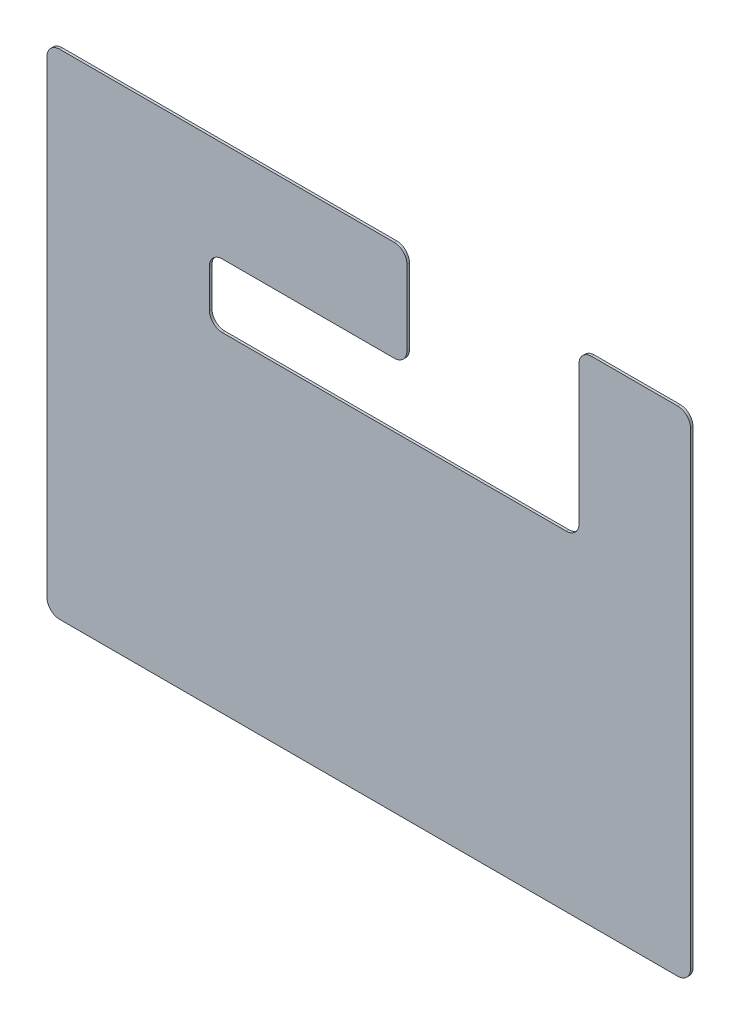
ISO-10303-21;
HEADER;
FILE_DESCRIPTION(('STEP AP214'),'2;1');
FILE_NAME('part.step','',(''),(''),'','','');
FILE_SCHEMA(('AUTOMOTIVE_DESIGN { 1 0 10303 214 1 1 1 1 }'));
ENDSEC;
DATA;
#1=APPLICATION_CONTEXT('core data for automotive mechanical design processes');
#2=APPLICATION_PROTOCOL_DEFINITION('international standard','automotive_design',2000,#1);
#3=PRODUCT_CONTEXT('',#1,'mechanical');
#4=PRODUCT('Part','Part','',(#3));
#5=PRODUCT_RELATED_PRODUCT_CATEGORY('part','',(#4));
#6=PRODUCT_DEFINITION_FORMATION('','',#4);
#7=PRODUCT_DEFINITION_CONTEXT('part definition',#1,'design');
#8=PRODUCT_DEFINITION('design','',#6,#7);
#9=PRODUCT_DEFINITION_SHAPE('','',#8);
#10=(LENGTH_UNIT() NAMED_UNIT(*) SI_UNIT(.MILLI.,.METRE.));
#11=(NAMED_UNIT(*) PLANE_ANGLE_UNIT() SI_UNIT($,.RADIAN.));
#12=(NAMED_UNIT(*) SI_UNIT($,.STERADIAN.) SOLID_ANGLE_UNIT());
#13=UNCERTAINTY_MEASURE_WITH_UNIT(LENGTH_MEASURE(1.E-05),#10,'distance_accuracy_value','');
#14=(GEOMETRIC_REPRESENTATION_CONTEXT(3) GLOBAL_UNCERTAINTY_ASSIGNED_CONTEXT((#13)) GLOBAL_UNIT_ASSIGNED_CONTEXT((#10,
#11,#12)) REPRESENTATION_CONTEXT('',''));
#15=CARTESIAN_POINT('',(0.,0.,0.));
#16=DIRECTION('',(0.,0.,1.));
#17=DIRECTION('',(1.,0.,0.));
#18=AXIS2_PLACEMENT_3D('',#15,#16,#17);
#19=CARTESIAN_POINT('',(-505.,387.5,4.));
#20=DIRECTION('',(0.,-1.,0.));
#21=DIRECTION('',(0.,0.,-1.));
#22=AXIS2_PLACEMENT_3D('',#19,#20,#21);
#23=PLANE('',#22);
#24=DIRECTION('',(-1.,0.,0.));
#25=VECTOR('',#24,1.);
#26=CARTESIAN_POINT('',(-505.,387.5,0.));
#27=LINE('',#26,#25);
#28=CARTESIAN_POINT('',(485.,387.5,0.));
#29=VERTEX_POINT('',#28);
#30=CARTESIAN_POINT('',(350.,387.5,0.));
#31=VERTEX_POINT('',#30);
#32=EDGE_CURVE('E202',#29,#31,#27,.T.);
#33=ORIENTED_EDGE('',*,*,#32,.T.);
#34=DIRECTION('',(0.,0.,1.));
#35=VECTOR('',#34,1.);
#36=CARTESIAN_POINT('',(350.,387.5,4.));
#37=LINE('',#36,#35);
#38=CARTESIAN_POINT('',(350.,387.5,4.));
#39=VERTEX_POINT('',#38);
#40=EDGE_CURVE('E267',#31,#39,#37,.T.);
#41=ORIENTED_EDGE('',*,*,#40,.T.);
#42=DIRECTION('',(-1.,0.,0.));
#43=VECTOR('',#42,1.);
#44=CARTESIAN_POINT('',(-505.,387.5,4.));
#45=LINE('',#44,#43);
#46=CARTESIAN_POINT('',(485.,387.5,4.));
#47=VERTEX_POINT('',#46);
#48=EDGE_CURVE('E331',#47,#39,#45,.T.);
#49=ORIENTED_EDGE('',*,*,#48,.F.);
#50=DIRECTION('',(0.,0.,-1.));
#51=VECTOR('',#50,1.);
#52=CARTESIAN_POINT('',(485.,387.5,4.));
#53=LINE('',#52,#51);
#54=EDGE_CURVE('E223',#47,#29,#53,.T.);
#55=ORIENTED_EDGE('',*,*,#54,.T.);
#56=EDGE_LOOP('',(#33,#41,#49,#55));
#57=FACE_BOUND('',#56,.T.);
#58=ADVANCED_FACE('F33',(#57),#23,.F.);
#59=CARTESIAN_POINT('',(0.,0.,4.));
#60=DIRECTION('',(0.,0.,-1.));
#61=DIRECTION('',(-1.,0.,0.));
#62=AXIS2_PLACEMENT_3D('',#59,#60,#61);
#63=PLANE('',#62);
#64=DIRECTION('',(0.,-1.,0.));
#65=VECTOR('',#64,1.);
#66=CARTESIAN_POINT('',(60.,0.,4.));
#67=LINE('',#66,#65);
#68=CARTESIAN_POINT('',(60.,367.5,4.));
#69=VERTEX_POINT('',#68);
#70=CARTESIAN_POINT('',(60.,249.999999999998,4.));
#71=VERTEX_POINT('',#70);
#72=EDGE_CURVE('E310',#69,#71,#67,.T.);
#73=ORIENTED_EDGE('',*,*,#72,.F.);
#74=CARTESIAN_POINT('',(40.,367.5,4.));
#75=DIRECTION('',(0.,0.,-1.));
#76=DIRECTION('',(-1.,0.,0.));
#77=AXIS2_PLACEMENT_3D('',#74,#75,#76);
#78=CIRCLE('',#77,20.);
#79=CARTESIAN_POINT('',(40.,387.5,4.));
#80=VERTEX_POINT('',#79);
#81=EDGE_CURVE('E257',#69,#80,#78,.F.);
#82=ORIENTED_EDGE('',*,*,#81,.T.);
#83=CARTESIAN_POINT('',(-485.,387.5,4.));
#84=VERTEX_POINT('',#83);
#85=EDGE_CURVE('E200',#80,#84,#45,.T.);
#86=ORIENTED_EDGE('',*,*,#85,.T.);
#87=CARTESIAN_POINT('',(-485.,367.5,4.));
#88=DIRECTION('',(0.,0.,-1.));
#89=DIRECTION('',(-1.,0.,0.));
#90=AXIS2_PLACEMENT_3D('',#87,#88,#89);
#91=CIRCLE('',#90,20.);
#92=CARTESIAN_POINT('',(-505.,367.5,4.));
#93=VERTEX_POINT('',#92);
#94=EDGE_CURVE('E219',#84,#93,#91,.F.);
#95=ORIENTED_EDGE('',*,*,#94,.T.);
#96=DIRECTION('',(0.,-1.,0.));
#97=VECTOR('',#96,1.);
#98=CARTESIAN_POINT('',(-505.,-387.5,4.));
#99=LINE('',#98,#97);
#100=CARTESIAN_POINT('',(-505.,-367.5,4.));
#101=VERTEX_POINT('',#100);
#102=EDGE_CURVE('E334',#93,#101,#99,.T.);
#103=ORIENTED_EDGE('',*,*,#102,.T.);
#104=CARTESIAN_POINT('',(-485.,-367.5,4.));
#105=DIRECTION('',(0.,0.,-1.));
#106=DIRECTION('',(-1.,0.,0.));
#107=AXIS2_PLACEMENT_3D('',#104,#105,#106);
#108=CIRCLE('',#107,20.);
#109=CARTESIAN_POINT('',(-485.,-387.5,4.));
#110=VERTEX_POINT('',#109);
#111=EDGE_CURVE('E221',#101,#110,#108,.F.);
#112=ORIENTED_EDGE('',*,*,#111,.T.);
#113=DIRECTION('',(1.,0.,0.));
#114=VECTOR('',#113,1.);
#115=CARTESIAN_POINT('',(-505.,-387.5,4.));
#116=LINE('',#115,#114);
#117=CARTESIAN_POINT('',(485.,-387.5,4.));
#118=VERTEX_POINT('',#117);
#119=EDGE_CURVE('E189',#110,#118,#116,.T.);
#120=ORIENTED_EDGE('',*,*,#119,.T.);
#121=CARTESIAN_POINT('',(485.,-367.5,4.));
#122=DIRECTION('',(0.,0.,-1.));
#123=DIRECTION('',(-1.,0.,0.));
#124=AXIS2_PLACEMENT_3D('',#121,#122,#123);
#125=CIRCLE('',#124,20.);
#126=CARTESIAN_POINT('',(505.,-367.5,4.));
#127=VERTEX_POINT('',#126);
#128=EDGE_CURVE('E215',#118,#127,#125,.F.);
#129=ORIENTED_EDGE('',*,*,#128,.T.);
#130=DIRECTION('',(0.,1.,0.));
#131=VECTOR('',#130,1.);
#132=CARTESIAN_POINT('',(505.,-387.5,4.));
#133=LINE('',#132,#131);
#134=CARTESIAN_POINT('',(505.,367.5,4.));
#135=VERTEX_POINT('',#134);
#136=EDGE_CURVE('E196',#127,#135,#133,.T.);
#137=ORIENTED_EDGE('',*,*,#136,.T.);
#138=CARTESIAN_POINT('',(485.,367.5,4.));
#139=DIRECTION('',(0.,0.,-1.));
#140=DIRECTION('',(-1.,0.,0.));
#141=AXIS2_PLACEMENT_3D('',#138,#139,#140);
#142=CIRCLE('',#141,20.);
#143=EDGE_CURVE('E217',#135,#47,#142,.F.);
#144=ORIENTED_EDGE('',*,*,#143,.T.);
#145=ORIENTED_EDGE('',*,*,#48,.T.);
#146=CARTESIAN_POINT('',(350.,367.5,4.));
#147=DIRECTION('',(0.,0.,-1.));
#148=DIRECTION('',(-1.,0.,0.));
#149=AXIS2_PLACEMENT_3D('',#146,#147,#148);
#150=CIRCLE('',#149,20.);
#151=CARTESIAN_POINT('',(330.,367.5,4.));
#152=VERTEX_POINT('',#151);
#153=EDGE_CURVE('E255',#39,#152,#150,.F.);
#154=ORIENTED_EDGE('',*,*,#153,.T.);
#155=DIRECTION('',(0.,-1.,0.));
#156=VECTOR('',#155,1.);
#157=CARTESIAN_POINT('',(330.,1.11022302462516E-13,4.));
#158=LINE('',#157,#156);
#159=CARTESIAN_POINT('',(330.,149.999999999998,4.));
#160=VERTEX_POINT('',#159);
#161=EDGE_CURVE('E325',#152,#160,#158,.T.);
#162=ORIENTED_EDGE('',*,*,#161,.T.);
#163=CARTESIAN_POINT('',(310.,149.999999999998,4.));
#164=DIRECTION('',(0.,0.,-1.));
#165=DIRECTION('',(-1.,0.,0.));
#166=AXIS2_PLACEMENT_3D('',#163,#164,#165);
#167=CIRCLE('',#166,20.);
#168=CARTESIAN_POINT('',(310.,129.999999999998,3.99999999999994));
#169=VERTEX_POINT('',#168);
#170=EDGE_CURVE('E289',#160,#169,#167,.T.);
#171=ORIENTED_EDGE('',*,*,#170,.T.);
#172=DIRECTION('',(1.,0.,0.));
#173=VECTOR('',#172,1.);
#174=CARTESIAN_POINT('',(0.,129.999999999998,4.));
#175=LINE('',#174,#173);
#176=CARTESIAN_POINT('',(-230.,129.999999999998,4.00000000000005));
#177=VERTEX_POINT('',#176);
#178=EDGE_CURVE('E322',#177,#169,#175,.T.);
#179=ORIENTED_EDGE('',*,*,#178,.F.);
#180=CARTESIAN_POINT('',(-230.,149.999999999998,4.));
#181=DIRECTION('',(0.,0.,-1.));
#182=DIRECTION('',(-1.,0.,0.));
#183=AXIS2_PLACEMENT_3D('',#180,#181,#182);
#184=CIRCLE('',#183,20.);
#185=CARTESIAN_POINT('',(-250.,149.999999999997,3.99999999999998));
#186=VERTEX_POINT('',#185);
#187=EDGE_CURVE('E293',#177,#186,#184,.T.);
#188=ORIENTED_EDGE('',*,*,#187,.T.);
#189=DIRECTION('',(0.,0.999999999999995,0.));
#190=VECTOR('',#189,1.);
#191=CARTESIAN_POINT('',(-250.,0.,4.));
#192=LINE('',#191,#190);
#193=CARTESIAN_POINT('',(-250.,209.999999999996,3.99999999999997));
#194=VERTEX_POINT('',#193);
#195=EDGE_CURVE('E303',#186,#194,#192,.T.);
#196=ORIENTED_EDGE('',*,*,#195,.T.);
#197=CARTESIAN_POINT('',(-230.,209.999999999998,4.));
#198=DIRECTION('',(0.,0.,-1.));
#199=DIRECTION('',(-1.,0.,0.));
#200=AXIS2_PLACEMENT_3D('',#197,#198,#199);
#201=CIRCLE('',#200,20.);
#202=CARTESIAN_POINT('',(-230.,229.999999999998,4.00000000000004));
#203=VERTEX_POINT('',#202);
#204=EDGE_CURVE('E41',#194,#203,#201,.T.);
#205=ORIENTED_EDGE('',*,*,#204,.T.);
#206=DIRECTION('',(-1.,0.,0.));
#207=VECTOR('',#206,1.);
#208=CARTESIAN_POINT('',(0.,229.999999999998,4.));
#209=LINE('',#208,#207);
#210=CARTESIAN_POINT('',(40.,229.999999999998,4.));
#211=VERTEX_POINT('',#210);
#212=EDGE_CURVE('E302',#211,#203,#209,.T.);
#213=ORIENTED_EDGE('',*,*,#212,.F.);
#214=CARTESIAN_POINT('',(40.,249.999999999998,4.));
#215=DIRECTION('',(0.,0.,-1.));
#216=DIRECTION('',(-1.,0.,0.));
#217=AXIS2_PLACEMENT_3D('',#214,#215,#216);
#218=CIRCLE('',#217,20.);
#219=EDGE_CURVE('E253',#211,#71,#218,.F.);
#220=ORIENTED_EDGE('',*,*,#219,.T.);
#221=EDGE_LOOP('',(#73,#82,#86,#95,#103,#112,#120,#129,#137,#144,#145,#154,#162,#171,#179,#188,
#196,#205,#213,#220));
#222=FACE_BOUND('',#221,.T.);
#223=ADVANCED_FACE('F301',(#222),#63,.F.);
#224=CARTESIAN_POINT('',(0.,0.,0.));
#225=DIRECTION('',(0.,0.,-1.));
#226=DIRECTION('',(-1.,0.,0.));
#227=AXIS2_PLACEMENT_3D('',#224,#225,#226);
#228=PLANE('',#227);
#229=CARTESIAN_POINT('',(40.,387.5,0.));
#230=VERTEX_POINT('',#229);
#231=CARTESIAN_POINT('',(-485.,387.5,0.));
#232=VERTEX_POINT('',#231);
#233=EDGE_CURVE('E339',#230,#232,#27,.T.);
#234=ORIENTED_EDGE('',*,*,#233,.F.);
#235=CARTESIAN_POINT('',(40.,367.5,0.));
#236=DIRECTION('',(0.,0.,-1.));
#237=DIRECTION('',(-1.,0.,0.));
#238=AXIS2_PLACEMENT_3D('',#235,#236,#237);
#239=CIRCLE('',#238,20.);
#240=CARTESIAN_POINT('',(60.,367.5,0.));
#241=VERTEX_POINT('',#240);
#242=EDGE_CURVE('E265',#230,#241,#239,.T.);
#243=ORIENTED_EDGE('',*,*,#242,.T.);
#244=DIRECTION('',(0.,1.,0.));
#245=VECTOR('',#244,1.);
#246=CARTESIAN_POINT('',(60.,0.,0.));
#247=LINE('',#246,#245);
#248=CARTESIAN_POINT('',(60.,249.999999999998,0.));
#249=VERTEX_POINT('',#248);
#250=EDGE_CURVE('E234',#249,#241,#247,.T.);
#251=ORIENTED_EDGE('',*,*,#250,.F.);
#252=CARTESIAN_POINT('',(40.,249.999999999998,0.));
#253=DIRECTION('',(0.,0.,-1.));
#254=DIRECTION('',(-1.,0.,0.));
#255=AXIS2_PLACEMENT_3D('',#252,#253,#254);
#256=CIRCLE('',#255,20.);
#257=CARTESIAN_POINT('',(40.,229.999999999998,0.));
#258=VERTEX_POINT('',#257);
#259=EDGE_CURVE('E261',#249,#258,#256,.T.);
#260=ORIENTED_EDGE('',*,*,#259,.T.);
#261=DIRECTION('',(1.,0.,0.));
#262=VECTOR('',#261,1.);
#263=CARTESIAN_POINT('',(0.,229.999999999998,0.));
#264=LINE('',#263,#262);
#265=CARTESIAN_POINT('',(-230.,229.999999999998,0.));
#266=VERTEX_POINT('',#265);
#267=EDGE_CURVE('E237',#266,#258,#264,.T.);
#268=ORIENTED_EDGE('',*,*,#267,.F.);
#269=CARTESIAN_POINT('',(-230.,209.999999999998,0.));
#270=DIRECTION('',(0.,0.,-1.));
#271=DIRECTION('',(-1.,0.,0.));
#272=AXIS2_PLACEMENT_3D('',#269,#270,#271);
#273=CIRCLE('',#272,20.);
#274=CARTESIAN_POINT('',(-250.,209.999999999998,0.));
#275=VERTEX_POINT('',#274);
#276=EDGE_CURVE('E11',#266,#275,#273,.F.);
#277=ORIENTED_EDGE('',*,*,#276,.T.);
#278=DIRECTION('',(0.,-1.,0.));
#279=VECTOR('',#278,1.);
#280=CARTESIAN_POINT('',(-250.,0.,0.));
#281=LINE('',#280,#279);
#282=CARTESIAN_POINT('',(-250.,149.999999999998,0.));
#283=VERTEX_POINT('',#282);
#284=EDGE_CURVE('E240',#275,#283,#281,.T.);
#285=ORIENTED_EDGE('',*,*,#284,.T.);
#286=CARTESIAN_POINT('',(-230.,149.999999999998,0.));
#287=DIRECTION('',(0.,0.,-1.));
#288=DIRECTION('',(-1.,0.,0.));
#289=AXIS2_PLACEMENT_3D('',#286,#287,#288);
#290=CIRCLE('',#289,20.);
#291=CARTESIAN_POINT('',(-230.,129.999999999998,0.));
#292=VERTEX_POINT('',#291);
#293=EDGE_CURVE('E295',#283,#292,#290,.F.);
#294=ORIENTED_EDGE('',*,*,#293,.T.);
#295=DIRECTION('',(-1.,0.,0.));
#296=VECTOR('',#295,1.);
#297=CARTESIAN_POINT('',(0.,129.999999999998,0.));
#298=LINE('',#297,#296);
#299=CARTESIAN_POINT('',(310.,129.999999999998,0.));
#300=VERTEX_POINT('',#299);
#301=EDGE_CURVE('E242',#300,#292,#298,.T.);
#302=ORIENTED_EDGE('',*,*,#301,.F.);
#303=CARTESIAN_POINT('',(310.,149.999999999998,0.));
#304=DIRECTION('',(0.,0.,-1.));
#305=DIRECTION('',(-1.,0.,0.));
#306=AXIS2_PLACEMENT_3D('',#303,#304,#305);
#307=CIRCLE('',#306,20.);
#308=CARTESIAN_POINT('',(330.,149.999999999998,0.));
#309=VERTEX_POINT('',#308);
#310=EDGE_CURVE('E291',#300,#309,#307,.F.);
#311=ORIENTED_EDGE('',*,*,#310,.T.);
#312=DIRECTION('',(0.,1.,0.));
#313=VECTOR('',#312,1.);
#314=CARTESIAN_POINT('',(330.,1.1691628057854E-13,0.));
#315=LINE('',#314,#313);
#316=CARTESIAN_POINT('',(330.,367.5,0.));
#317=VERTEX_POINT('',#316);
#318=EDGE_CURVE('E245',#309,#317,#315,.T.);
#319=ORIENTED_EDGE('',*,*,#318,.T.);
#320=CARTESIAN_POINT('',(350.,367.5,0.));
#321=DIRECTION('',(0.,0.,-1.));
#322=DIRECTION('',(-1.,0.,0.));
#323=AXIS2_PLACEMENT_3D('',#320,#321,#322);
#324=CIRCLE('',#323,20.);
#325=EDGE_CURVE('E263',#317,#31,#324,.T.);
#326=ORIENTED_EDGE('',*,*,#325,.T.);
#327=ORIENTED_EDGE('',*,*,#32,.F.);
#328=CARTESIAN_POINT('',(485.,367.5,0.));
#329=DIRECTION('',(0.,0.,-1.));
#330=DIRECTION('',(-1.,0.,0.));
#331=AXIS2_PLACEMENT_3D('',#328,#329,#330);
#332=CIRCLE('',#331,20.);
#333=CARTESIAN_POINT('',(505.,367.5,0.));
#334=VERTEX_POINT('',#333);
#335=EDGE_CURVE('E208',#29,#334,#332,.T.);
#336=ORIENTED_EDGE('',*,*,#335,.T.);
#337=DIRECTION('',(0.,1.,0.));
#338=VECTOR('',#337,1.);
#339=CARTESIAN_POINT('',(505.,-387.5,0.));
#340=LINE('',#339,#338);
#341=CARTESIAN_POINT('',(505.,-367.5,0.));
#342=VERTEX_POINT('',#341);
#343=EDGE_CURVE('E327',#342,#334,#340,.T.);
#344=ORIENTED_EDGE('',*,*,#343,.F.);
#345=CARTESIAN_POINT('',(485.,-367.5,0.));
#346=DIRECTION('',(0.,0.,-1.));
#347=DIRECTION('',(-1.,0.,0.));
#348=AXIS2_PLACEMENT_3D('',#345,#346,#347);
#349=CIRCLE('',#348,20.);
#350=CARTESIAN_POINT('',(485.,-387.5,0.));
#351=VERTEX_POINT('',#350);
#352=EDGE_CURVE('E190',#342,#351,#349,.T.);
#353=ORIENTED_EDGE('',*,*,#352,.T.);
#354=DIRECTION('',(1.,0.,0.));
#355=VECTOR('',#354,1.);
#356=CARTESIAN_POINT('',(-505.,-387.5,0.));
#357=LINE('',#356,#355);
#358=CARTESIAN_POINT('',(-485.,-387.5,0.));
#359=VERTEX_POINT('',#358);
#360=EDGE_CURVE('E186',#359,#351,#357,.T.);
#361=ORIENTED_EDGE('',*,*,#360,.F.);
#362=CARTESIAN_POINT('',(-485.,-367.5,0.));
#363=DIRECTION('',(0.,0.,-1.));
#364=DIRECTION('',(-1.,0.,0.));
#365=AXIS2_PLACEMENT_3D('',#362,#363,#364);
#366=CIRCLE('',#365,20.);
#367=CARTESIAN_POINT('',(-505.,-367.5,0.));
#368=VERTEX_POINT('',#367);
#369=EDGE_CURVE('E170',#359,#368,#366,.T.);
#370=ORIENTED_EDGE('',*,*,#369,.T.);
#371=DIRECTION('',(0.,-1.,0.));
#372=VECTOR('',#371,1.);
#373=CARTESIAN_POINT('',(-505.,-387.5,0.));
#374=LINE('',#373,#372);
#375=CARTESIAN_POINT('',(-505.,367.5,0.));
#376=VERTEX_POINT('',#375);
#377=EDGE_CURVE('E197',#376,#368,#374,.T.);
#378=ORIENTED_EDGE('',*,*,#377,.F.);
#379=CARTESIAN_POINT('',(-485.,367.5,0.));
#380=DIRECTION('',(0.,0.,-1.));
#381=DIRECTION('',(-1.,0.,0.));
#382=AXIS2_PLACEMENT_3D('',#379,#380,#381);
#383=CIRCLE('',#382,20.);
#384=EDGE_CURVE('E180',#376,#232,#383,.T.);
#385=ORIENTED_EDGE('',*,*,#384,.T.);
#386=EDGE_LOOP('',(#234,#243,#251,#260,#268,#277,#285,#294,#302,#311,#319,#326,#327,#336,#344,
#353,#361,#370,#378,#385));
#387=FACE_BOUND('',#386,.T.);
#388=ADVANCED_FACE('F194',(#387),#228,.T.);
#389=CARTESIAN_POINT('',(505.,-387.5,4.));
#390=DIRECTION('',(-1.,0.,0.));
#391=DIRECTION('',(0.,0.,1.));
#392=AXIS2_PLACEMENT_3D('',#389,#390,#391);
#393=PLANE('',#392);
#394=ORIENTED_EDGE('',*,*,#343,.T.);
#395=DIRECTION('',(0.,0.,-1.));
#396=VECTOR('',#395,1.);
#397=CARTESIAN_POINT('',(505.,367.5,4.));
#398=LINE('',#397,#396);
#399=EDGE_CURVE('E232',#334,#135,#398,.F.);
#400=ORIENTED_EDGE('',*,*,#399,.T.);
#401=ORIENTED_EDGE('',*,*,#136,.F.);
#402=DIRECTION('',(0.,0.,-1.));
#403=VECTOR('',#402,1.);
#404=CARTESIAN_POINT('',(505.,-367.5,4.));
#405=LINE('',#404,#403);
#406=EDGE_CURVE('E229',#127,#342,#405,.T.);
#407=ORIENTED_EDGE('',*,*,#406,.T.);
#408=EDGE_LOOP('',(#394,#400,#401,#407));
#409=FACE_BOUND('',#408,.T.);
#410=ADVANCED_FACE('F365',(#409),#393,.F.);
#411=ORIENTED_EDGE('',*,*,#85,.F.);
#412=DIRECTION('',(0.,0.,1.));
#413=VECTOR('',#412,1.);
#414=CARTESIAN_POINT('',(40.,387.5,4.));
#415=LINE('',#414,#413);
#416=EDGE_CURVE('E259',#80,#230,#415,.F.);
#417=ORIENTED_EDGE('',*,*,#416,.T.);
#418=ORIENTED_EDGE('',*,*,#233,.T.);
#419=DIRECTION('',(0.,0.,-1.));
#420=VECTOR('',#419,1.);
#421=CARTESIAN_POINT('',(-485.,387.5,4.));
#422=LINE('',#421,#420);
#423=EDGE_CURVE('E226',#232,#84,#422,.F.);
#424=ORIENTED_EDGE('',*,*,#423,.T.);
#425=EDGE_LOOP('',(#411,#417,#418,#424));
#426=FACE_BOUND('',#425,.T.);
#427=ADVANCED_FACE('F346',(#426),#23,.F.);
#428=CARTESIAN_POINT('',(-505.,-387.5,4.));
#429=DIRECTION('',(1.,0.,0.));
#430=DIRECTION('',(0.,0.,-1.));
#431=AXIS2_PLACEMENT_3D('',#428,#429,#430);
#432=PLANE('',#431);
#433=ORIENTED_EDGE('',*,*,#377,.T.);
#434=DIRECTION('',(0.,0.,-1.));
#435=VECTOR('',#434,1.);
#436=CARTESIAN_POINT('',(-505.,-367.5,4.));
#437=LINE('',#436,#435);
#438=EDGE_CURVE('E175',#368,#101,#437,.F.);
#439=ORIENTED_EDGE('',*,*,#438,.T.);
#440=ORIENTED_EDGE('',*,*,#102,.F.);
#441=DIRECTION('',(0.,0.,-1.));
#442=VECTOR('',#441,1.);
#443=CARTESIAN_POINT('',(-505.,367.5,4.));
#444=LINE('',#443,#442);
#445=EDGE_CURVE('E179',#93,#376,#444,.T.);
#446=ORIENTED_EDGE('',*,*,#445,.T.);
#447=EDGE_LOOP('',(#433,#439,#440,#446));
#448=FACE_BOUND('',#447,.T.);
#449=ADVANCED_FACE('F356',(#448),#432,.F.);
#450=CARTESIAN_POINT('',(-505.,-387.5,4.));
#451=DIRECTION('',(0.,1.,0.));
#452=DIRECTION('',(0.,0.,1.));
#453=AXIS2_PLACEMENT_3D('',#450,#451,#452);
#454=PLANE('',#453);
#455=ORIENTED_EDGE('',*,*,#119,.F.);
#456=DIRECTION('',(0.,0.,-1.));
#457=VECTOR('',#456,1.);
#458=CARTESIAN_POINT('',(-485.,-387.5,4.));
#459=LINE('',#458,#457);
#460=EDGE_CURVE('E174',#110,#359,#459,.T.);
#461=ORIENTED_EDGE('',*,*,#460,.T.);
#462=ORIENTED_EDGE('',*,*,#360,.T.);
#463=DIRECTION('',(0.,0.,-1.));
#464=VECTOR('',#463,1.);
#465=CARTESIAN_POINT('',(485.,-387.5,4.));
#466=LINE('',#465,#464);
#467=EDGE_CURVE('E191',#351,#118,#466,.F.);
#468=ORIENTED_EDGE('',*,*,#467,.T.);
#469=EDGE_LOOP('',(#455,#461,#462,#468));
#470=FACE_BOUND('',#469,.T.);
#471=ADVANCED_FACE('F185',(#470),#454,.F.);
#472=CARTESIAN_POINT('',(-485.,-367.5,4.));
#473=DIRECTION('',(0.,0.,-1.));
#474=DIRECTION('',(-1.,0.,0.));
#475=AXIS2_PLACEMENT_3D('',#472,#473,#474);
#476=CYLINDRICAL_SURFACE('',#475,20.);
#477=ORIENTED_EDGE('',*,*,#111,.F.);
#478=ORIENTED_EDGE('',*,*,#438,.F.);
#479=ORIENTED_EDGE('',*,*,#369,.F.);
#480=ORIENTED_EDGE('',*,*,#460,.F.);
#481=EDGE_LOOP('',(#477,#478,#479,#480));
#482=FACE_BOUND('',#481,.T.);
#483=ADVANCED_FACE('F173',(#482),#476,.T.);
#484=CARTESIAN_POINT('',(-485.,367.5,4.));
#485=DIRECTION('',(0.,0.,-1.));
#486=DIRECTION('',(-1.,0.,0.));
#487=AXIS2_PLACEMENT_3D('',#484,#485,#486);
#488=CYLINDRICAL_SURFACE('',#487,20.);
#489=ORIENTED_EDGE('',*,*,#94,.F.);
#490=ORIENTED_EDGE('',*,*,#423,.F.);
#491=ORIENTED_EDGE('',*,*,#384,.F.);
#492=ORIENTED_EDGE('',*,*,#445,.F.);
#493=EDGE_LOOP('',(#489,#490,#491,#492));
#494=FACE_BOUND('',#493,.T.);
#495=ADVANCED_FACE('F353',(#494),#488,.T.);
#496=CARTESIAN_POINT('',(485.,367.5,4.));
#497=DIRECTION('',(0.,0.,-1.));
#498=DIRECTION('',(-1.,0.,0.));
#499=AXIS2_PLACEMENT_3D('',#496,#497,#498);
#500=CYLINDRICAL_SURFACE('',#499,20.);
#501=ORIENTED_EDGE('',*,*,#143,.F.);
#502=ORIENTED_EDGE('',*,*,#399,.F.);
#503=ORIENTED_EDGE('',*,*,#335,.F.);
#504=ORIENTED_EDGE('',*,*,#54,.F.);
#505=EDGE_LOOP('',(#501,#502,#503,#504));
#506=FACE_BOUND('',#505,.T.);
#507=ADVANCED_FACE('F381',(#506),#500,.T.);
#508=CARTESIAN_POINT('',(485.,-367.5,4.));
#509=DIRECTION('',(0.,0.,-1.));
#510=DIRECTION('',(-1.,0.,0.));
#511=AXIS2_PLACEMENT_3D('',#508,#509,#510);
#512=CYLINDRICAL_SURFACE('',#511,20.);
#513=ORIENTED_EDGE('',*,*,#128,.F.);
#514=ORIENTED_EDGE('',*,*,#467,.F.);
#515=ORIENTED_EDGE('',*,*,#352,.F.);
#516=ORIENTED_EDGE('',*,*,#406,.F.);
#517=EDGE_LOOP('',(#513,#514,#515,#516));
#518=FACE_BOUND('',#517,.T.);
#519=ADVANCED_FACE('F384',(#518),#512,.T.);
#520=CARTESIAN_POINT('',(330.,1.11022302462516E-13,-6.));
#521=DIRECTION('',(-1.,0.,0.));
#522=DIRECTION('',(0.,-1.,0.));
#523=AXIS2_PLACEMENT_3D('',#520,#521,#522);
#524=PLANE('',#523);
#525=ORIENTED_EDGE('',*,*,#161,.F.);
#526=DIRECTION('',(0.,0.,1.));
#527=VECTOR('',#526,1.);
#528=CARTESIAN_POINT('',(330.,367.5,0.));
#529=LINE('',#528,#527);
#530=EDGE_CURVE('E273',#152,#317,#529,.F.);
#531=ORIENTED_EDGE('',*,*,#530,.T.);
#532=ORIENTED_EDGE('',*,*,#318,.F.);
#533=DIRECTION('',(0.,0.,1.));
#534=VECTOR('',#533,1.);
#535=CARTESIAN_POINT('',(330.,149.999999999998,-6.));
#536=LINE('',#535,#534);
#537=EDGE_CURVE('E270',#309,#160,#536,.T.);
#538=ORIENTED_EDGE('',*,*,#537,.T.);
#539=EDGE_LOOP('',(#525,#531,#532,#538));
#540=FACE_BOUND('',#539,.T.);
#541=ADVANCED_FACE('F388',(#540),#524,.T.);
#542=CARTESIAN_POINT('',(0.,129.999999999998,-6.));
#543=DIRECTION('',(0.,-1.,0.));
#544=DIRECTION('',(1.,0.,0.));
#545=AXIS2_PLACEMENT_3D('',#542,#543,#544);
#546=PLANE('',#545);
#547=ORIENTED_EDGE('',*,*,#178,.T.);
#548=DIRECTION('',(0.,0.,1.));
#549=VECTOR('',#548,1.);
#550=CARTESIAN_POINT('',(310.,129.999999999998,-6.));
#551=LINE('',#550,#549);
#552=EDGE_CURVE('E278',#169,#300,#551,.F.);
#553=ORIENTED_EDGE('',*,*,#552,.T.);
#554=ORIENTED_EDGE('',*,*,#301,.T.);
#555=DIRECTION('',(0.,0.,1.));
#556=VECTOR('',#555,1.);
#557=CARTESIAN_POINT('',(-230.,129.999999999998,-6.));
#558=LINE('',#557,#556);
#559=EDGE_CURVE('E275',#292,#177,#558,.T.);
#560=ORIENTED_EDGE('',*,*,#559,.T.);
#561=EDGE_LOOP('',(#547,#553,#554,#560));
#562=FACE_BOUND('',#561,.T.);
#563=ADVANCED_FACE('F321',(#562),#546,.F.);
#564=CARTESIAN_POINT('',(-250.,0.,-6.));
#565=DIRECTION('',(1.,0.,0.));
#566=DIRECTION('',(0.,1.,0.));
#567=AXIS2_PLACEMENT_3D('',#564,#565,#566);
#568=PLANE('',#567);
#569=ORIENTED_EDGE('',*,*,#195,.F.);
#570=DIRECTION('',(0.,0.,1.));
#571=VECTOR('',#570,1.);
#572=CARTESIAN_POINT('',(-250.,149.999999999998,-6.));
#573=LINE('',#572,#571);
#574=EDGE_CURVE('E48',#186,#283,#573,.F.);
#575=ORIENTED_EDGE('',*,*,#574,.T.);
#576=ORIENTED_EDGE('',*,*,#284,.F.);
#577=DIRECTION('',(0.,0.,1.));
#578=VECTOR('',#577,1.);
#579=CARTESIAN_POINT('',(-250.,209.999999999998,-6.));
#580=LINE('',#579,#578);
#581=EDGE_CURVE('E285',#275,#194,#580,.T.);
#582=ORIENTED_EDGE('',*,*,#581,.T.);
#583=EDGE_LOOP('',(#569,#575,#576,#582));
#584=FACE_BOUND('',#583,.T.);
#585=ADVANCED_FACE('F312',(#584),#568,.T.);
#586=CARTESIAN_POINT('',(0.,229.999999999998,-6.));
#587=DIRECTION('',(0.,1.,0.));
#588=DIRECTION('',(-1.,0.,0.));
#589=AXIS2_PLACEMENT_3D('',#586,#587,#588);
#590=PLANE('',#589);
#591=ORIENTED_EDGE('',*,*,#267,.T.);
#592=DIRECTION('',(0.,0.,1.));
#593=VECTOR('',#592,1.);
#594=CARTESIAN_POINT('',(40.,229.999999999998,-6.));
#595=LINE('',#594,#593);
#596=EDGE_CURVE('E282',#258,#211,#595,.T.);
#597=ORIENTED_EDGE('',*,*,#596,.T.);
#598=ORIENTED_EDGE('',*,*,#212,.T.);
#599=DIRECTION('',(0.,0.,1.));
#600=VECTOR('',#599,1.);
#601=CARTESIAN_POINT('',(-230.,229.999999999998,-6.));
#602=LINE('',#601,#600);
#603=EDGE_CURVE('E280',#203,#266,#602,.F.);
#604=ORIENTED_EDGE('',*,*,#603,.T.);
#605=EDGE_LOOP('',(#591,#597,#598,#604));
#606=FACE_BOUND('',#605,.T.);
#607=ADVANCED_FACE('F308',(#606),#590,.F.);
#608=CARTESIAN_POINT('',(60.,0.,-6.));
#609=DIRECTION('',(-1.,0.,0.));
#610=DIRECTION('',(0.,-1.,0.));
#611=AXIS2_PLACEMENT_3D('',#608,#609,#610);
#612=PLANE('',#611);
#613=ORIENTED_EDGE('',*,*,#250,.T.);
#614=DIRECTION('',(0.,0.,1.));
#615=VECTOR('',#614,1.);
#616=CARTESIAN_POINT('',(60.,367.5,-6.));
#617=LINE('',#616,#615);
#618=EDGE_CURVE('E250',#241,#69,#617,.T.);
#619=ORIENTED_EDGE('',*,*,#618,.T.);
#620=ORIENTED_EDGE('',*,*,#72,.T.);
#621=DIRECTION('',(0.,0.,1.));
#622=VECTOR('',#621,1.);
#623=CARTESIAN_POINT('',(60.,249.999999999998,-6.));
#624=LINE('',#623,#622);
#625=EDGE_CURVE('E248',#71,#249,#624,.F.);
#626=ORIENTED_EDGE('',*,*,#625,.T.);
#627=EDGE_LOOP('',(#613,#619,#620,#626));
#628=FACE_BOUND('',#627,.T.);
#629=ADVANCED_FACE('F394',(#628),#612,.F.);
#630=CARTESIAN_POINT('',(40.,367.5,-6.));
#631=DIRECTION('',(0.,0.,1.));
#632=DIRECTION('',(1.,0.,0.));
#633=AXIS2_PLACEMENT_3D('',#630,#631,#632);
#634=CYLINDRICAL_SURFACE('',#633,20.);
#635=ORIENTED_EDGE('',*,*,#242,.F.);
#636=ORIENTED_EDGE('',*,*,#416,.F.);
#637=ORIENTED_EDGE('',*,*,#81,.F.);
#638=ORIENTED_EDGE('',*,*,#618,.F.);
#639=EDGE_LOOP('',(#635,#636,#637,#638));
#640=FACE_BOUND('',#639,.T.);
#641=ADVANCED_FACE('F390',(#640),#634,.T.);
#642=CARTESIAN_POINT('',(350.,367.5,4.));
#643=DIRECTION('',(0.,0.,-1.));
#644=DIRECTION('',(-1.,0.,0.));
#645=AXIS2_PLACEMENT_3D('',#642,#643,#644);
#646=CYLINDRICAL_SURFACE('',#645,20.);
#647=ORIENTED_EDGE('',*,*,#325,.F.);
#648=ORIENTED_EDGE('',*,*,#530,.F.);
#649=ORIENTED_EDGE('',*,*,#153,.F.);
#650=ORIENTED_EDGE('',*,*,#40,.F.);
#651=EDGE_LOOP('',(#647,#648,#649,#650));
#652=FACE_BOUND('',#651,.T.);
#653=ADVANCED_FACE('F393',(#652),#646,.T.);
#654=CARTESIAN_POINT('',(310.,149.999999999998,-6.));
#655=DIRECTION('',(0.,0.,1.));
#656=DIRECTION('',(1.,0.,0.));
#657=AXIS2_PLACEMENT_3D('',#654,#655,#656);
#658=CYLINDRICAL_SURFACE('',#657,20.);
#659=ORIENTED_EDGE('',*,*,#310,.F.);
#660=ORIENTED_EDGE('',*,*,#552,.F.);
#661=ORIENTED_EDGE('',*,*,#170,.F.);
#662=ORIENTED_EDGE('',*,*,#537,.F.);
#663=EDGE_LOOP('',(#659,#660,#661,#662));
#664=FACE_BOUND('',#663,.T.);
#665=ADVANCED_FACE('F398',(#664),#658,.F.);
#666=CARTESIAN_POINT('',(40.,249.999999999998,-6.));
#667=DIRECTION('',(0.,0.,1.));
#668=DIRECTION('',(1.,0.,0.));
#669=AXIS2_PLACEMENT_3D('',#666,#667,#668);
#670=CYLINDRICAL_SURFACE('',#669,20.);
#671=ORIENTED_EDGE('',*,*,#259,.F.);
#672=ORIENTED_EDGE('',*,*,#625,.F.);
#673=ORIENTED_EDGE('',*,*,#219,.F.);
#674=ORIENTED_EDGE('',*,*,#596,.F.);
#675=EDGE_LOOP('',(#671,#672,#673,#674));
#676=FACE_BOUND('',#675,.T.);
#677=ADVANCED_FACE('F402',(#676),#670,.T.);
#678=CARTESIAN_POINT('',(-230.,149.999999999998,-6.));
#679=DIRECTION('',(0.,0.,1.));
#680=DIRECTION('',(1.,0.,0.));
#681=AXIS2_PLACEMENT_3D('',#678,#679,#680);
#682=CYLINDRICAL_SURFACE('',#681,20.);
#683=ORIENTED_EDGE('',*,*,#293,.F.);
#684=ORIENTED_EDGE('',*,*,#574,.F.);
#685=ORIENTED_EDGE('',*,*,#187,.F.);
#686=ORIENTED_EDGE('',*,*,#559,.F.);
#687=EDGE_LOOP('',(#683,#684,#685,#686));
#688=FACE_BOUND('',#687,.T.);
#689=ADVANCED_FACE('F317',(#688),#682,.F.);
#690=CARTESIAN_POINT('',(-230.,209.999999999998,-6.));
#691=DIRECTION('',(0.,0.,1.));
#692=DIRECTION('',(1.,0.,0.));
#693=AXIS2_PLACEMENT_3D('',#690,#691,#692);
#694=CYLINDRICAL_SURFACE('',#693,20.);
#695=ORIENTED_EDGE('',*,*,#276,.F.);
#696=ORIENTED_EDGE('',*,*,#603,.F.);
#697=ORIENTED_EDGE('',*,*,#204,.F.);
#698=ORIENTED_EDGE('',*,*,#581,.F.);
#699=EDGE_LOOP('',(#695,#696,#697,#698));
#700=FACE_BOUND('',#699,.T.);
#701=ADVANCED_FACE('F35',(#700),#694,.F.);
#702=CLOSED_SHELL('',(#58,#223,#388,#410,#427,#449,#471,#483,#495,#507,#519,#541,#563,#585,#607,
#629,#641,#653,#665,#677,#689,#701));
#703=MANIFOLD_SOLID_BREP('B2',#702);
#704=ADVANCED_BREP_SHAPE_REPRESENTATION('',(#18,#703),#14);
#705=SHAPE_DEFINITION_REPRESENTATION(#9,#704);
ENDSEC;
END-ISO-10303-21;
